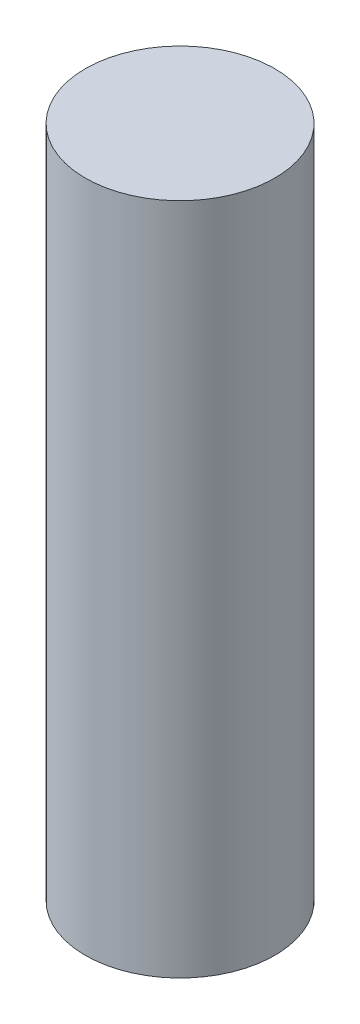
ISO-10303-21;
HEADER;
FILE_DESCRIPTION(('STEP AP214'),'2;1');
FILE_NAME('part.step','',(''),(''),'','','');
FILE_SCHEMA(('AUTOMOTIVE_DESIGN { 1 0 10303 214 1 1 1 1 }'));
ENDSEC;
DATA;
#1=APPLICATION_CONTEXT('core data for automotive mechanical design processes');
#2=APPLICATION_PROTOCOL_DEFINITION('international standard','automotive_design',2000,#1);
#3=PRODUCT_CONTEXT('',#1,'mechanical');
#4=PRODUCT('Part','Part','',(#3));
#5=PRODUCT_RELATED_PRODUCT_CATEGORY('part','',(#4));
#6=PRODUCT_DEFINITION_FORMATION('','',#4);
#7=PRODUCT_DEFINITION_CONTEXT('part definition',#1,'design');
#8=PRODUCT_DEFINITION('design','',#6,#7);
#9=PRODUCT_DEFINITION_SHAPE('','',#8);
#10=(LENGTH_UNIT() NAMED_UNIT(*) SI_UNIT(.MILLI.,.METRE.));
#11=(NAMED_UNIT(*) PLANE_ANGLE_UNIT() SI_UNIT($,.RADIAN.));
#12=(NAMED_UNIT(*) SI_UNIT($,.STERADIAN.) SOLID_ANGLE_UNIT());
#13=UNCERTAINTY_MEASURE_WITH_UNIT(LENGTH_MEASURE(1.E-05),#10,'distance_accuracy_value','');
#14=(GEOMETRIC_REPRESENTATION_CONTEXT(3) GLOBAL_UNCERTAINTY_ASSIGNED_CONTEXT((#13)) GLOBAL_UNIT_ASSIGNED_CONTEXT((#10,
#11,#12)) REPRESENTATION_CONTEXT('',''));
#15=CARTESIAN_POINT('',(0.,0.,0.));
#16=DIRECTION('',(0.,0.,1.));
#17=DIRECTION('',(1.,0.,0.));
#18=AXIS2_PLACEMENT_3D('',#15,#16,#17);
#19=CARTESIAN_POINT('',(0.,32.5,0.));
#20=DIRECTION('',(0.,1.,0.));
#21=DIRECTION('',(-1.,0.,0.));
#22=AXIS2_PLACEMENT_3D('',#19,#20,#21);
#23=CYLINDRICAL_SURFACE('',#22,9.14999999999999);
#24=CARTESIAN_POINT('',(0.,-32.5,0.));
#25=DIRECTION('',(0.,1.,0.));
#26=DIRECTION('',(-1.,0.,0.));
#27=AXIS2_PLACEMENT_3D('',#24,#25,#26);
#28=CIRCLE('',#27,9.15);
#29=CARTESIAN_POINT('',(-9.14999999999999,-32.5,0.));
#30=VERTEX_POINT('',#29);
#31=EDGE_CURVE('E10',#30,#30,#28,.T.);
#32=ORIENTED_EDGE('',*,*,#31,.T.);
#33=EDGE_LOOP('',(#32));
#34=FACE_BOUND('',#33,.T.);
#35=CARTESIAN_POINT('',(0.,32.5,0.));
#36=DIRECTION('',(0.,1.,0.));
#37=DIRECTION('',(-1.,0.,0.));
#38=AXIS2_PLACEMENT_3D('',#35,#36,#37);
#39=CIRCLE('',#38,9.14999999999998);
#40=CARTESIAN_POINT('',(-9.14999999999999,32.5,0.));
#41=VERTEX_POINT('',#40);
#42=EDGE_CURVE('E40',#41,#41,#39,.T.);
#43=ORIENTED_EDGE('',*,*,#42,.F.);
#44=EDGE_LOOP('',(#43));
#45=FACE_BOUND('',#44,.T.);
#46=ADVANCED_FACE('F34',(#34,#45),#23,.T.);
#47=CARTESIAN_POINT('',(-9.14999999999999,-32.5,0.));
#48=DIRECTION('',(0.,-1.,0.));
#49=DIRECTION('',(1.,0.,0.));
#50=AXIS2_PLACEMENT_3D('',#47,#48,#49);
#51=PLANE('',#50);
#52=ORIENTED_EDGE('',*,*,#31,.F.);
#53=EDGE_LOOP('',(#52));
#54=FACE_BOUND('',#53,.T.);
#55=ADVANCED_FACE('F49',(#54),#51,.T.);
#56=CARTESIAN_POINT('',(-9.14999999999999,32.5,0.));
#57=DIRECTION('',(0.,1.,0.));
#58=DIRECTION('',(-1.,0.,0.));
#59=AXIS2_PLACEMENT_3D('',#56,#57,#58);
#60=PLANE('',#59);
#61=ORIENTED_EDGE('',*,*,#42,.T.);
#62=EDGE_LOOP('',(#61));
#63=FACE_BOUND('',#62,.T.);
#64=ADVANCED_FACE('F46',(#63),#60,.T.);
#65=CLOSED_SHELL('',(#46,#55,#64));
#66=MANIFOLD_SOLID_BREP('B2',#65);
#67=ADVANCED_BREP_SHAPE_REPRESENTATION('',(#18,#66),#14);
#68=SHAPE_DEFINITION_REPRESENTATION(#9,#67);
ENDSEC;
END-ISO-10303-21;
